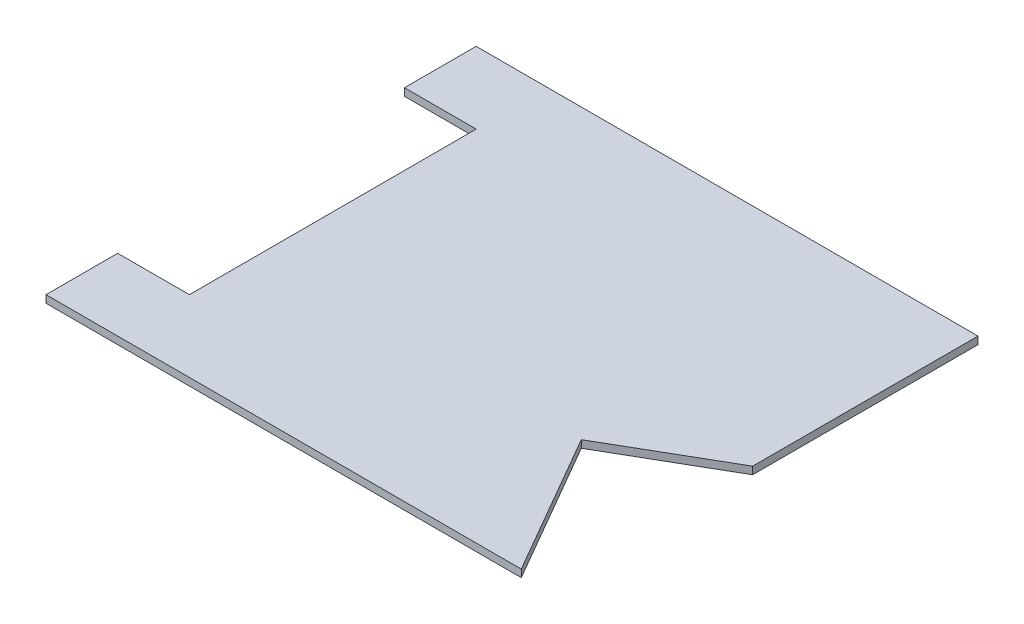
ISO-10303-21;
HEADER;
FILE_DESCRIPTION(('STEP AP214'),'2;1');
FILE_NAME('part.step','',(''),(''),'','','');
FILE_SCHEMA(('AUTOMOTIVE_DESIGN { 1 0 10303 214 1 1 1 1 }'));
ENDSEC;
DATA;
#1=APPLICATION_CONTEXT('core data for automotive mechanical design processes');
#2=APPLICATION_PROTOCOL_DEFINITION('international standard','automotive_design',2000,#1);
#3=PRODUCT_CONTEXT('',#1,'mechanical');
#4=PRODUCT('Part','Part','',(#3));
#5=PRODUCT_RELATED_PRODUCT_CATEGORY('part','',(#4));
#6=PRODUCT_DEFINITION_FORMATION('','',#4);
#7=PRODUCT_DEFINITION_CONTEXT('part definition',#1,'design');
#8=PRODUCT_DEFINITION('design','',#6,#7);
#9=PRODUCT_DEFINITION_SHAPE('','',#8);
#10=(LENGTH_UNIT() NAMED_UNIT(*) SI_UNIT(.MILLI.,.METRE.));
#11=(NAMED_UNIT(*) PLANE_ANGLE_UNIT() SI_UNIT($,.RADIAN.));
#12=(NAMED_UNIT(*) SI_UNIT($,.STERADIAN.) SOLID_ANGLE_UNIT());
#13=UNCERTAINTY_MEASURE_WITH_UNIT(LENGTH_MEASURE(1.E-05),#10,'distance_accuracy_value','');
#14=(GEOMETRIC_REPRESENTATION_CONTEXT(3) GLOBAL_UNCERTAINTY_ASSIGNED_CONTEXT((#13)) GLOBAL_UNIT_ASSIGNED_CONTEXT((#10,
#11,#12)) REPRESENTATION_CONTEXT('',''));
#15=CARTESIAN_POINT('',(0.,0.,0.));
#16=DIRECTION('',(0.,0.,1.));
#17=DIRECTION('',(1.,0.,0.));
#18=AXIS2_PLACEMENT_3D('',#15,#16,#17);
#19=CARTESIAN_POINT('',(0.,15.875,0.));
#20=DIRECTION('',(1.,0.,0.));
#21=DIRECTION('',(0.,0.,-1.));
#22=AXIS2_PLACEMENT_3D('',#19,#20,#21);
#23=PLANE('',#22);
#24=DIRECTION('',(0.,0.,1.));
#25=VECTOR('',#24,1.);
#26=CARTESIAN_POINT('',(0.,0.,0.));
#27=LINE('',#26,#25);
#28=CARTESIAN_POINT('',(0.,0.,0.));
#29=VERTEX_POINT('',#28);
#30=CARTESIAN_POINT('',(0.,0.,152.4));
#31=VERTEX_POINT('',#30);
#32=EDGE_CURVE('E139',#29,#31,#27,.T.);
#33=ORIENTED_EDGE('',*,*,#32,.T.);
#34=DIRECTION('',(0.,-1.,0.));
#35=VECTOR('',#34,1.);
#36=CARTESIAN_POINT('',(0.,15.875,152.4));
#37=LINE('',#36,#35);
#38=CARTESIAN_POINT('',(0.,15.875,152.4));
#39=VERTEX_POINT('',#38);
#40=EDGE_CURVE('E11',#39,#31,#37,.T.);
#41=ORIENTED_EDGE('',*,*,#40,.F.);
#42=DIRECTION('',(0.,0.,1.));
#43=VECTOR('',#42,1.);
#44=CARTESIAN_POINT('',(0.,15.875,0.));
#45=LINE('',#44,#43);
#46=CARTESIAN_POINT('',(0.,15.875,0.));
#47=VERTEX_POINT('',#46);
#48=EDGE_CURVE('E157',#47,#39,#45,.T.);
#49=ORIENTED_EDGE('',*,*,#48,.F.);
#50=DIRECTION('',(0.,-1.,0.));
#51=VECTOR('',#50,1.);
#52=CARTESIAN_POINT('',(0.,15.875,0.));
#53=LINE('',#52,#51);
#54=EDGE_CURVE('E135',#47,#29,#53,.T.);
#55=ORIENTED_EDGE('',*,*,#54,.T.);
#56=EDGE_LOOP('',(#33,#41,#49,#55));
#57=FACE_BOUND('',#56,.T.);
#58=ADVANCED_FACE('F31',(#57),#23,.F.);
#59=CARTESIAN_POINT('',(0.,15.875,152.4));
#60=DIRECTION('',(0.,0.,-1.));
#61=DIRECTION('',(-1.,0.,0.));
#62=AXIS2_PLACEMENT_3D('',#59,#60,#61);
#63=PLANE('',#62);
#64=DIRECTION('',(1.,0.,0.));
#65=VECTOR('',#64,1.);
#66=CARTESIAN_POINT('',(0.,0.,152.4));
#67=LINE('',#66,#65);
#68=CARTESIAN_POINT('',(152.4,0.,152.4));
#69=VERTEX_POINT('',#68);
#70=EDGE_CURVE('E142',#31,#69,#67,.T.);
#71=ORIENTED_EDGE('',*,*,#70,.T.);
#72=DIRECTION('',(0.,-1.,0.));
#73=VECTOR('',#72,1.);
#74=CARTESIAN_POINT('',(152.4,15.875,152.4));
#75=LINE('',#74,#73);
#76=CARTESIAN_POINT('',(152.4,15.875,152.4));
#77=VERTEX_POINT('',#76);
#78=EDGE_CURVE('E39',#77,#69,#75,.T.);
#79=ORIENTED_EDGE('',*,*,#78,.F.);
#80=DIRECTION('',(1.,0.,0.));
#81=VECTOR('',#80,1.);
#82=CARTESIAN_POINT('',(0.,15.875,152.4));
#83=LINE('',#82,#81);
#84=EDGE_CURVE('E96',#39,#77,#83,.T.);
#85=ORIENTED_EDGE('',*,*,#84,.F.);
#86=ORIENTED_EDGE('',*,*,#40,.T.);
#87=EDGE_LOOP('',(#71,#79,#85,#86));
#88=FACE_BOUND('',#87,.T.);
#89=ADVANCED_FACE('F206',(#88),#63,.F.);
#90=CARTESIAN_POINT('',(152.4,15.875,152.4));
#91=DIRECTION('',(1.,0.,0.));
#92=DIRECTION('',(0.,0.,-1.));
#93=AXIS2_PLACEMENT_3D('',#90,#91,#92);
#94=PLANE('',#93);
#95=DIRECTION('',(0.,0.,1.));
#96=VECTOR('',#95,1.);
#97=CARTESIAN_POINT('',(152.4,0.,152.4));
#98=LINE('',#97,#96);
#99=CARTESIAN_POINT('',(152.4,0.,762.));
#100=VERTEX_POINT('',#99);
#101=EDGE_CURVE('E144',#69,#100,#98,.T.);
#102=ORIENTED_EDGE('',*,*,#101,.T.);
#103=DIRECTION('',(0.,-1.,0.));
#104=VECTOR('',#103,1.);
#105=CARTESIAN_POINT('',(152.4,15.875,762.));
#106=LINE('',#105,#104);
#107=CARTESIAN_POINT('',(152.4,15.875,762.));
#108=VERTEX_POINT('',#107);
#109=EDGE_CURVE('E170',#108,#100,#106,.T.);
#110=ORIENTED_EDGE('',*,*,#109,.F.);
#111=DIRECTION('',(0.,0.,1.));
#112=VECTOR('',#111,1.);
#113=CARTESIAN_POINT('',(152.4,15.875,152.4));
#114=LINE('',#113,#112);
#115=EDGE_CURVE('E178',#77,#108,#114,.T.);
#116=ORIENTED_EDGE('',*,*,#115,.F.);
#117=ORIENTED_EDGE('',*,*,#78,.T.);
#118=EDGE_LOOP('',(#102,#110,#116,#117));
#119=FACE_BOUND('',#118,.T.);
#120=ADVANCED_FACE('F176',(#119),#94,.F.);
#121=CARTESIAN_POINT('',(1.11981703314034E-13,15.875,762.));
#122=DIRECTION('',(0.,0.,1.));
#123=DIRECTION('',(1.,0.,0.));
#124=AXIS2_PLACEMENT_3D('',#121,#122,#123);
#125=PLANE('',#124);
#126=DIRECTION('',(-1.,0.,0.));
#127=VECTOR('',#126,1.);
#128=CARTESIAN_POINT('',(1.11981703314034E-13,0.,762.));
#129=LINE('',#128,#127);
#130=CARTESIAN_POINT('',(1.11981703314034E-13,0.,762.));
#131=VERTEX_POINT('',#130);
#132=EDGE_CURVE('E146',#100,#131,#129,.T.);
#133=ORIENTED_EDGE('',*,*,#132,.T.);
#134=DIRECTION('',(0.,-1.,0.));
#135=VECTOR('',#134,1.);
#136=CARTESIAN_POINT('',(1.11981703314034E-13,15.875,762.));
#137=LINE('',#136,#135);
#138=CARTESIAN_POINT('',(1.11981703314034E-13,15.875,762.));
#139=VERTEX_POINT('',#138);
#140=EDGE_CURVE('E167',#139,#131,#137,.T.);
#141=ORIENTED_EDGE('',*,*,#140,.F.);
#142=DIRECTION('',(-1.,0.,0.));
#143=VECTOR('',#142,1.);
#144=CARTESIAN_POINT('',(1.11981703314034E-13,15.875,762.));
#145=LINE('',#144,#143);
#146=EDGE_CURVE('E196',#108,#139,#145,.T.);
#147=ORIENTED_EDGE('',*,*,#146,.F.);
#148=ORIENTED_EDGE('',*,*,#109,.T.);
#149=EDGE_LOOP('',(#133,#141,#147,#148));
#150=FACE_BOUND('',#149,.T.);
#151=ADVANCED_FACE('F187',(#150),#125,.F.);
#152=CARTESIAN_POINT('',(1.11981703314034E-13,15.875,762.));
#153=DIRECTION('',(1.,0.,0.));
#154=DIRECTION('',(0.,0.,-1.));
#155=AXIS2_PLACEMENT_3D('',#152,#153,#154);
#156=PLANE('',#155);
#157=DIRECTION('',(0.,0.,1.));
#158=VECTOR('',#157,1.);
#159=CARTESIAN_POINT('',(1.11981703314034E-13,0.,762.));
#160=LINE('',#159,#158);
#161=CARTESIAN_POINT('',(1.11981703314034E-13,0.,914.4));
#162=VERTEX_POINT('',#161);
#163=EDGE_CURVE('E148',#131,#162,#160,.T.);
#164=ORIENTED_EDGE('',*,*,#163,.T.);
#165=DIRECTION('',(0.,-1.,0.));
#166=VECTOR('',#165,1.);
#167=CARTESIAN_POINT('',(1.11981703314034E-13,15.875,914.4));
#168=LINE('',#167,#166);
#169=CARTESIAN_POINT('',(1.11981703314034E-13,15.875,914.4));
#170=VERTEX_POINT('',#169);
#171=EDGE_CURVE('E164',#170,#162,#168,.T.);
#172=ORIENTED_EDGE('',*,*,#171,.F.);
#173=DIRECTION('',(0.,0.,1.));
#174=VECTOR('',#173,1.);
#175=CARTESIAN_POINT('',(1.11981703314034E-13,15.875,762.));
#176=LINE('',#175,#174);
#177=EDGE_CURVE('E193',#139,#170,#176,.T.);
#178=ORIENTED_EDGE('',*,*,#177,.F.);
#179=ORIENTED_EDGE('',*,*,#140,.T.);
#180=EDGE_LOOP('',(#164,#172,#178,#179));
#181=FACE_BOUND('',#180,.T.);
#182=ADVANCED_FACE('F191',(#181),#156,.F.);
#183=CARTESIAN_POINT('',(1.11981703314034E-13,15.875,914.4));
#184=DIRECTION('',(0.,0.,-1.));
#185=DIRECTION('',(-1.,0.,0.));
#186=AXIS2_PLACEMENT_3D('',#183,#184,#185);
#187=PLANE('',#186);
#188=DIRECTION('',(1.,0.,0.));
#189=VECTOR('',#188,1.);
#190=CARTESIAN_POINT('',(1.11981703314034E-13,0.,914.4));
#191=LINE('',#190,#189);
#192=CARTESIAN_POINT('',(1010.285,0.,914.4));
#193=VERTEX_POINT('',#192);
#194=EDGE_CURVE('E150',#162,#193,#191,.T.);
#195=ORIENTED_EDGE('',*,*,#194,.T.);
#196=DIRECTION('',(0.,-1.,0.));
#197=VECTOR('',#196,1.);
#198=CARTESIAN_POINT('',(1010.285,15.875,914.4));
#199=LINE('',#198,#197);
#200=CARTESIAN_POINT('',(1010.285,15.875,914.4));
#201=VERTEX_POINT('',#200);
#202=EDGE_CURVE('E161',#201,#193,#199,.T.);
#203=ORIENTED_EDGE('',*,*,#202,.F.);
#204=DIRECTION('',(1.,0.,0.));
#205=VECTOR('',#204,1.);
#206=CARTESIAN_POINT('',(1.11981703314034E-13,15.875,914.4));
#207=LINE('',#206,#205);
#208=EDGE_CURVE('E195',#170,#201,#207,.T.);
#209=ORIENTED_EDGE('',*,*,#208,.F.);
#210=ORIENTED_EDGE('',*,*,#171,.T.);
#211=EDGE_LOOP('',(#195,#203,#209,#210));
#212=FACE_BOUND('',#211,.T.);
#213=ADVANCED_FACE('F218',(#212),#187,.F.);
#214=CARTESIAN_POINT('',(1010.285,15.875,914.4));
#215=DIRECTION('',(-0.866020654818436,0.,0.50000822536019));
#216=DIRECTION('',(0.500008225360191,0.,0.866020654818436));
#217=AXIS2_PLACEMENT_3D('',#214,#215,#216);
#218=PLANE('',#217);
#219=DIRECTION('',(-0.500008225360191,0.,-0.866020654818436));
#220=VECTOR('',#219,1.);
#221=CARTESIAN_POINT('',(1010.285,0.,914.4));
#222=LINE('',#221,#220);
#223=CARTESIAN_POINT('',(835.8886,0.,612.3432));
#224=VERTEX_POINT('',#223);
#225=EDGE_CURVE('E152',#193,#224,#222,.T.);
#226=ORIENTED_EDGE('',*,*,#225,.T.);
#227=DIRECTION('',(0.,-1.,0.));
#228=VECTOR('',#227,1.);
#229=CARTESIAN_POINT('',(835.8886,15.875,612.3432));
#230=LINE('',#229,#228);
#231=CARTESIAN_POINT('',(835.8886,15.875,612.3432));
#232=VERTEX_POINT('',#231);
#233=EDGE_CURVE('E130',#232,#224,#230,.T.);
#234=ORIENTED_EDGE('',*,*,#233,.F.);
#235=DIRECTION('',(-0.500008225360191,0.,-0.866020654818436));
#236=VECTOR('',#235,1.);
#237=CARTESIAN_POINT('',(1010.285,15.875,914.4));
#238=LINE('',#237,#236);
#239=EDGE_CURVE('E121',#201,#232,#238,.T.);
#240=ORIENTED_EDGE('',*,*,#239,.F.);
#241=ORIENTED_EDGE('',*,*,#202,.T.);
#242=EDGE_LOOP('',(#226,#234,#240,#241));
#243=FACE_BOUND('',#242,.T.);
#244=ADVANCED_FACE('F221',(#243),#218,.F.);
#245=CARTESIAN_POINT('',(835.8886,15.875,612.3432));
#246=DIRECTION('',(-0.500022055211314,0.,-0.866012669827788));
#247=DIRECTION('',(-0.866012669827788,0.,0.500022055211314));
#248=AXIS2_PLACEMENT_3D('',#245,#246,#247);
#249=PLANE('',#248);
#250=DIRECTION('',(0.866012669827788,0.,-0.500022055211314));
#251=VECTOR('',#250,1.);
#252=CARTESIAN_POINT('',(835.8886,0.,612.3432));
#253=LINE('',#252,#251);
#254=CARTESIAN_POINT('',(1066.8,0.,479.0186));
#255=VERTEX_POINT('',#254);
#256=EDGE_CURVE('E129',#224,#255,#253,.T.);
#257=ORIENTED_EDGE('',*,*,#256,.T.);
#258=DIRECTION('',(0.,-1.,0.));
#259=VECTOR('',#258,1.);
#260=CARTESIAN_POINT('',(1066.8,15.875,479.0186));
#261=LINE('',#260,#259);
#262=CARTESIAN_POINT('',(1066.8,15.875,479.0186));
#263=VERTEX_POINT('',#262);
#264=EDGE_CURVE('E126',#263,#255,#261,.T.);
#265=ORIENTED_EDGE('',*,*,#264,.F.);
#266=DIRECTION('',(0.866012669827788,0.,-0.500022055211314));
#267=VECTOR('',#266,1.);
#268=CARTESIAN_POINT('',(835.8886,15.875,612.3432));
#269=LINE('',#268,#267);
#270=EDGE_CURVE('E115',#232,#263,#269,.T.);
#271=ORIENTED_EDGE('',*,*,#270,.F.);
#272=ORIENTED_EDGE('',*,*,#233,.T.);
#273=EDGE_LOOP('',(#257,#265,#271,#272));
#274=FACE_BOUND('',#273,.T.);
#275=ADVANCED_FACE('F127',(#274),#249,.F.);
#276=CARTESIAN_POINT('',(1066.8,15.875,0.));
#277=DIRECTION('',(-1.,0.,0.));
#278=DIRECTION('',(0.,0.,1.));
#279=AXIS2_PLACEMENT_3D('',#276,#277,#278);
#280=PLANE('',#279);
#281=DIRECTION('',(0.,0.,-1.));
#282=VECTOR('',#281,1.);
#283=CARTESIAN_POINT('',(1066.8,0.,0.));
#284=LINE('',#283,#282);
#285=CARTESIAN_POINT('',(1066.8,0.,0.));
#286=VERTEX_POINT('',#285);
#287=EDGE_CURVE('E82',#255,#286,#284,.T.);
#288=ORIENTED_EDGE('',*,*,#287,.T.);
#289=DIRECTION('',(0.,-1.,0.));
#290=VECTOR('',#289,1.);
#291=CARTESIAN_POINT('',(1066.8,15.875,0.));
#292=LINE('',#291,#290);
#293=CARTESIAN_POINT('',(1066.8,15.875,0.));
#294=VERTEX_POINT('',#293);
#295=EDGE_CURVE('E131',#294,#286,#292,.T.);
#296=ORIENTED_EDGE('',*,*,#295,.F.);
#297=DIRECTION('',(0.,0.,-1.));
#298=VECTOR('',#297,1.);
#299=CARTESIAN_POINT('',(1066.8,15.875,0.));
#300=LINE('',#299,#298);
#301=EDGE_CURVE('E119',#263,#294,#300,.T.);
#302=ORIENTED_EDGE('',*,*,#301,.F.);
#303=ORIENTED_EDGE('',*,*,#264,.T.);
#304=EDGE_LOOP('',(#288,#296,#302,#303));
#305=FACE_BOUND('',#304,.T.);
#306=ADVANCED_FACE('F133',(#305),#280,.F.);
#307=CARTESIAN_POINT('',(0.,15.875,0.));
#308=DIRECTION('',(0.,0.,1.));
#309=DIRECTION('',(1.,0.,0.));
#310=AXIS2_PLACEMENT_3D('',#307,#308,#309);
#311=PLANE('',#310);
#312=DIRECTION('',(-1.,0.,0.));
#313=VECTOR('',#312,1.);
#314=CARTESIAN_POINT('',(0.,0.,0.));
#315=LINE('',#314,#313);
#316=EDGE_CURVE('E88',#286,#29,#315,.T.);
#317=ORIENTED_EDGE('',*,*,#316,.T.);
#318=ORIENTED_EDGE('',*,*,#54,.F.);
#319=DIRECTION('',(-1.,0.,0.));
#320=VECTOR('',#319,1.);
#321=CARTESIAN_POINT('',(0.,15.875,0.));
#322=LINE('',#321,#320);
#323=EDGE_CURVE('E47',#294,#47,#322,.T.);
#324=ORIENTED_EDGE('',*,*,#323,.F.);
#325=ORIENTED_EDGE('',*,*,#295,.T.);
#326=EDGE_LOOP('',(#317,#318,#324,#325));
#327=FACE_BOUND('',#326,.T.);
#328=ADVANCED_FACE('F230',(#327),#311,.F.);
#329=CARTESIAN_POINT('',(0.,15.875,152.4));
#330=DIRECTION('',(0.,1.,0.));
#331=DIRECTION('',(0.,0.,1.));
#332=AXIS2_PLACEMENT_3D('',#329,#330,#331);
#333=PLANE('',#332);
#334=ORIENTED_EDGE('',*,*,#48,.T.);
#335=ORIENTED_EDGE('',*,*,#84,.T.);
#336=ORIENTED_EDGE('',*,*,#115,.T.);
#337=ORIENTED_EDGE('',*,*,#146,.T.);
#338=ORIENTED_EDGE('',*,*,#177,.T.);
#339=ORIENTED_EDGE('',*,*,#208,.T.);
#340=ORIENTED_EDGE('',*,*,#239,.T.);
#341=ORIENTED_EDGE('',*,*,#270,.T.);
#342=ORIENTED_EDGE('',*,*,#301,.T.);
#343=ORIENTED_EDGE('',*,*,#323,.T.);
#344=EDGE_LOOP('',(#334,#335,#336,#337,#338,#339,#340,#341,#342,#343));
#345=FACE_BOUND('',#344,.T.);
#346=ADVANCED_FACE('F117',(#345),#333,.T.);
#347=CARTESIAN_POINT('',(0.,0.,152.4));
#348=DIRECTION('',(0.,1.,0.));
#349=DIRECTION('',(0.,0.,1.));
#350=AXIS2_PLACEMENT_3D('',#347,#348,#349);
#351=PLANE('',#350);
#352=ORIENTED_EDGE('',*,*,#32,.F.);
#353=ORIENTED_EDGE('',*,*,#316,.F.);
#354=ORIENTED_EDGE('',*,*,#287,.F.);
#355=ORIENTED_EDGE('',*,*,#256,.F.);
#356=ORIENTED_EDGE('',*,*,#225,.F.);
#357=ORIENTED_EDGE('',*,*,#194,.F.);
#358=ORIENTED_EDGE('',*,*,#163,.F.);
#359=ORIENTED_EDGE('',*,*,#132,.F.);
#360=ORIENTED_EDGE('',*,*,#101,.F.);
#361=ORIENTED_EDGE('',*,*,#70,.F.);
#362=EDGE_LOOP('',(#352,#353,#354,#355,#356,#357,#358,#359,#360,#361));
#363=FACE_BOUND('',#362,.T.);
#364=ADVANCED_FACE('F182',(#363),#351,.F.);
#365=CLOSED_SHELL('',(#58,#89,#120,#151,#182,#213,#244,#275,#306,#328,#346,#364));
#366=MANIFOLD_SOLID_BREP('B2',#365);
#367=ADVANCED_BREP_SHAPE_REPRESENTATION('',(#18,#366),#14);
#368=SHAPE_DEFINITION_REPRESENTATION(#9,#367);
ENDSEC;
END-ISO-10303-21;
